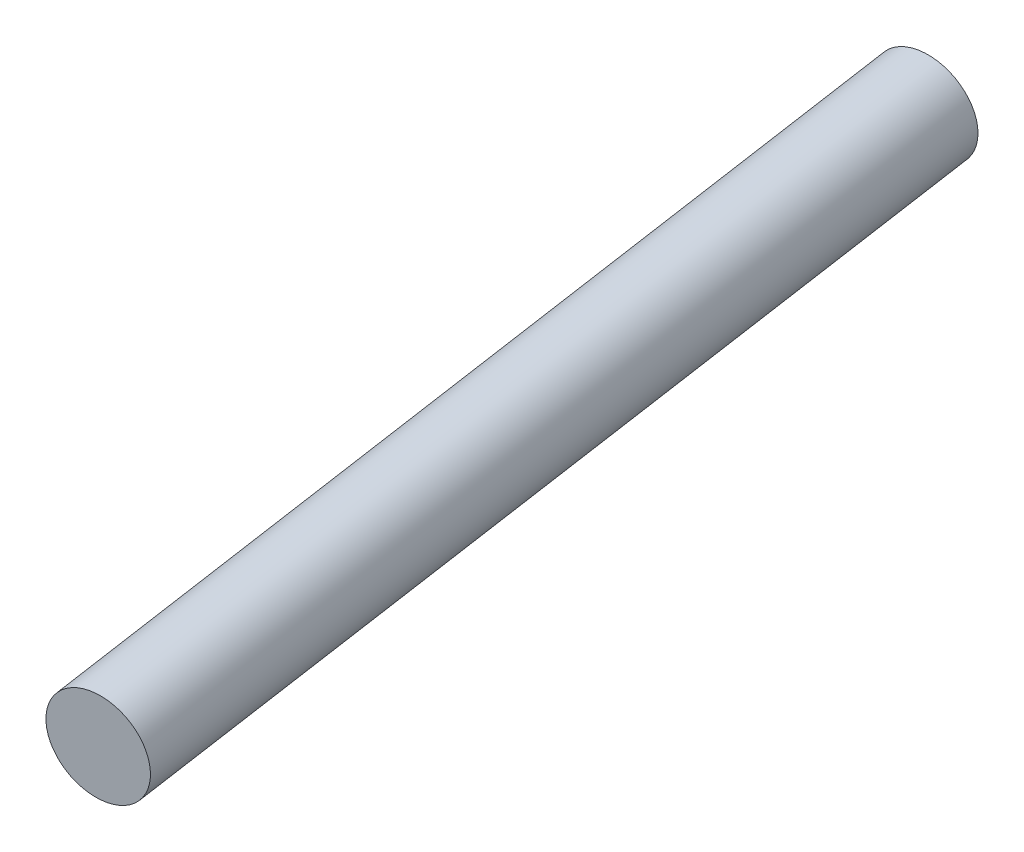
ISO-10303-21;
HEADER;
FILE_DESCRIPTION(('STEP AP214'),'2;1');
FILE_NAME('part.step','',(''),(''),'','','');
FILE_SCHEMA(('AUTOMOTIVE_DESIGN { 1 0 10303 214 1 1 1 1 }'));
ENDSEC;
DATA;
#1=APPLICATION_CONTEXT('core data for automotive mechanical design processes');
#2=APPLICATION_PROTOCOL_DEFINITION('international standard','automotive_design',2000,#1);
#3=PRODUCT_CONTEXT('',#1,'mechanical');
#4=PRODUCT('Part','Part','',(#3));
#5=PRODUCT_RELATED_PRODUCT_CATEGORY('part','',(#4));
#6=PRODUCT_DEFINITION_FORMATION('','',#4);
#7=PRODUCT_DEFINITION_CONTEXT('part definition',#1,'design');
#8=PRODUCT_DEFINITION('design','',#6,#7);
#9=PRODUCT_DEFINITION_SHAPE('','',#8);
#10=(LENGTH_UNIT() NAMED_UNIT(*) SI_UNIT(.MILLI.,.METRE.));
#11=(NAMED_UNIT(*) PLANE_ANGLE_UNIT() SI_UNIT($,.RADIAN.));
#12=(NAMED_UNIT(*) SI_UNIT($,.STERADIAN.) SOLID_ANGLE_UNIT());
#13=UNCERTAINTY_MEASURE_WITH_UNIT(LENGTH_MEASURE(1.E-05),#10,'distance_accuracy_value','');
#14=(GEOMETRIC_REPRESENTATION_CONTEXT(3) GLOBAL_UNCERTAINTY_ASSIGNED_CONTEXT((#13)) GLOBAL_UNIT_ASSIGNED_CONTEXT((#10,
#11,#12)) REPRESENTATION_CONTEXT('',''));
#15=CARTESIAN_POINT('',(0.,0.,0.));
#16=DIRECTION('',(0.,0.,1.));
#17=DIRECTION('',(1.,0.,0.));
#18=AXIS2_PLACEMENT_3D('',#15,#16,#17);
#19=CARTESIAN_POINT('',(6.0897122929621,-4.13701145934185,65.9499306076627));
#20=DIRECTION('',(0.091768408113352,-0.0623423468476925,0.99382694220969));
#21=DIRECTION('',(0.995763878167334,0.,-0.0919472617164303));
#22=AXIS2_PLACEMENT_3D('',#19,#20,#21);
#23=PLANE('',#22);
#24=CARTESIAN_POINT('',(-73.4814728431502,-13.2478979433593,72.7258859177336));
#25=DIRECTION('',(0.091768408113352,-0.0623423468476925,0.99382694220969));
#26=DIRECTION('',(0.995763878167334,0.,-0.0919472617164303));
#27=AXIS2_PLACEMENT_3D('',#24,#25,#26);
#28=CIRCLE('',#27,6.35000000000002);
#29=CARTESIAN_POINT('',(-67.1583722167876,-13.2478979433593,72.1420208058343));
#30=VERTEX_POINT('',#29);
#31=EDGE_CURVE('E11',#30,#30,#28,.F.);
#32=ORIENTED_EDGE('',*,*,#31,.F.);
#33=EDGE_LOOP('',(#32));
#34=FACE_BOUND('',#33,.T.);
#35=ADVANCED_FACE('F44',(#34),#23,.T.);
#36=CARTESIAN_POINT('',(-84.6246879490559,-5.67781804971304,-47.9521079884902));
#37=DIRECTION('',(-0.0917684081133533,0.0623423468476922,-0.99382694220969));
#38=DIRECTION('',(-0.995763878167334,0.,0.0919472617164316));
#39=AXIS2_PLACEMENT_3D('',#36,#37,#38);
#40=PLANE('',#39);
#41=CARTESIAN_POINT('',(-84.6246879490559,-5.67781804971304,-47.9521079884902));
#42=DIRECTION('',(-0.0917684081133533,0.0623423468476922,-0.99382694220969));
#43=DIRECTION('',(-0.995763878167334,0.,0.0919472617164316));
#44=AXIS2_PLACEMENT_3D('',#41,#42,#43);
#45=CIRCLE('',#44,6.35000000000002);
#46=CARTESIAN_POINT('',(-90.9477885754185,-5.67781804971304,-47.3682428765908));
#47=VERTEX_POINT('',#46);
#48=EDGE_CURVE('E50',#47,#47,#45,.T.);
#49=ORIENTED_EDGE('',*,*,#48,.T.);
#50=EDGE_LOOP('',(#49));
#51=FACE_BOUND('',#50,.T.);
#52=ADVANCED_FACE('F56',(#51),#40,.T.);
#53=CARTESIAN_POINT('',(-71.8332652257887,-14.3675984271209,90.5755268798577));
#54=DIRECTION('',(-0.0917684081133533,0.0623423468476922,-0.99382694220969));
#55=DIRECTION('',(-0.995763878167334,0.,0.0919472617164316));
#56=AXIS2_PLACEMENT_3D('',#53,#54,#55);
#57=CYLINDRICAL_SURFACE('',#56,6.35000000000002);
#58=ORIENTED_EDGE('',*,*,#48,.F.);
#59=EDGE_LOOP('',(#58));
#60=FACE_BOUND('',#59,.T.);
#61=ORIENTED_EDGE('',*,*,#31,.T.);
#62=EDGE_LOOP('',(#61));
#63=FACE_BOUND('',#62,.T.);
#64=ADVANCED_FACE('F58',(#60,#63),#57,.T.);
#65=CLOSED_SHELL('',(#35,#52,#64));
#66=MANIFOLD_SOLID_BREP('B2',#65);
#67=ADVANCED_BREP_SHAPE_REPRESENTATION('',(#18,#66),#14);
#68=SHAPE_DEFINITION_REPRESENTATION(#9,#67);
ENDSEC;
END-ISO-10303-21;
